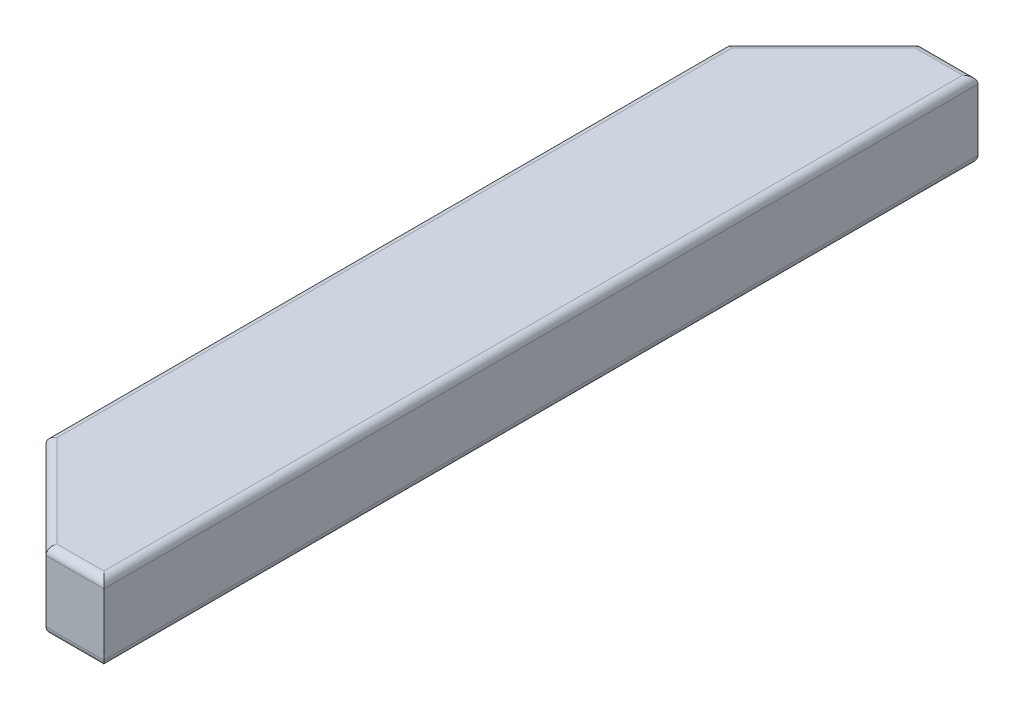
ISO-10303-21;
HEADER;
FILE_DESCRIPTION(('STEP AP214'),'2;1');
FILE_NAME('part.step','',(''),(''),'','','');
FILE_SCHEMA(('AUTOMOTIVE_DESIGN { 1 0 10303 214 1 1 1 1 }'));
ENDSEC;
DATA;
#1=APPLICATION_CONTEXT('core data for automotive mechanical design processes');
#2=APPLICATION_PROTOCOL_DEFINITION('international standard','automotive_design',2000,#1);
#3=PRODUCT_CONTEXT('',#1,'mechanical');
#4=PRODUCT('Part','Part','',(#3));
#5=PRODUCT_RELATED_PRODUCT_CATEGORY('part','',(#4));
#6=PRODUCT_DEFINITION_FORMATION('','',#4);
#7=PRODUCT_DEFINITION_CONTEXT('part definition',#1,'design');
#8=PRODUCT_DEFINITION('design','',#6,#7);
#9=PRODUCT_DEFINITION_SHAPE('','',#8);
#10=(LENGTH_UNIT() NAMED_UNIT(*) SI_UNIT(.MILLI.,.METRE.));
#11=(NAMED_UNIT(*) PLANE_ANGLE_UNIT() SI_UNIT($,.RADIAN.));
#12=(NAMED_UNIT(*) SI_UNIT($,.STERADIAN.) SOLID_ANGLE_UNIT());
#13=UNCERTAINTY_MEASURE_WITH_UNIT(LENGTH_MEASURE(1.E-05),#10,'distance_accuracy_value','');
#14=(GEOMETRIC_REPRESENTATION_CONTEXT(3) GLOBAL_UNCERTAINTY_ASSIGNED_CONTEXT((#13)) GLOBAL_UNIT_ASSIGNED_CONTEXT((#10,
#11,#12)) REPRESENTATION_CONTEXT('',''));
#15=CARTESIAN_POINT('',(0.,0.,0.));
#16=DIRECTION('',(0.,0.,1.));
#17=DIRECTION('',(1.,0.,0.));
#18=AXIS2_PLACEMENT_3D('',#15,#16,#17);
#19=CARTESIAN_POINT('',(0.,5.3444781408848E-12,287.699999999991));
#20=DIRECTION('',(0.,0.,-1.));
#21=DIRECTION('',(0.,1.,0.));
#22=AXIS2_PLACEMENT_3D('',#19,#20,#21);
#23=PLANE('',#22);
#24=DIRECTION('',(0.,1.,0.));
#25=VECTOR('',#24,1.);
#26=CARTESIAN_POINT('',(2676.19999999996,-12.7000000000022,287.699999999991));
#27=LINE('',#26,#25);
#28=CARTESIAN_POINT('',(2676.19999999996,-7.61999999998973,287.699999999991));
#29=VERTEX_POINT('',#28);
#30=CARTESIAN_POINT('',(2676.19999999996,33.0200000000108,287.699999999991));
#31=VERTEX_POINT('',#30);
#32=EDGE_CURVE('E290',#29,#31,#27,.T.);
#33=ORIENTED_EDGE('',*,*,#32,.F.);
#34=DIRECTION('',(-1.,0.,0.));
#35=VECTOR('',#34,1.);
#36=CARTESIAN_POINT('',(0.,-7.61999999998973,287.699999999991));
#37=LINE('',#36,#35);
#38=CARTESIAN_POINT('',(2714.29999999996,-7.61999999998973,287.699999999991));
#39=VERTEX_POINT('',#38);
#40=EDGE_CURVE('E187',#29,#39,#37,.F.);
#41=ORIENTED_EDGE('',*,*,#40,.T.);
#42=DIRECTION('',(0.,-1.,0.));
#43=VECTOR('',#42,1.);
#44=CARTESIAN_POINT('',(2714.29999999996,38.1000000000108,287.69999999999));
#45=LINE('',#44,#43);
#46=CARTESIAN_POINT('',(2714.29999999996,33.0200000000108,287.69999999999));
#47=VERTEX_POINT('',#46);
#48=EDGE_CURVE('E169',#47,#39,#45,.T.);
#49=ORIENTED_EDGE('',*,*,#48,.F.);
#50=DIRECTION('',(1.,0.,0.));
#51=VECTOR('',#50,1.);
#52=CARTESIAN_POINT('',(0.,33.0200000000108,287.69999999999));
#53=LINE('',#52,#51);
#54=EDGE_CURVE('E183',#47,#31,#53,.F.);
#55=ORIENTED_EDGE('',*,*,#54,.T.);
#56=EDGE_LOOP('',(#33,#41,#49,#55));
#57=FACE_BOUND('',#56,.T.);
#58=ADVANCED_FACE('F43',(#57),#23,.F.);
#59=CARTESIAN_POINT('',(2714.29999999996,38.0999999999983,-401.292253256991));
#60=DIRECTION('',(0.,-1.,0.));
#61=DIRECTION('',(0.,0.,-1.));
#62=AXIS2_PLACEMENT_3D('',#59,#60,#61);
#63=PLANE('',#62);
#64=DIRECTION('',(0.707106781186546,0.,-0.707106781186549));
#65=VECTOR('',#64,1.);
#66=CARTESIAN_POINT('',(2755.63822907689,38.0999999999991,-359.954024180063));
#67=LINE('',#66,#65);
#68=CARTESIAN_POINT('',(2678.30420489683,38.1000000000005,-282.620000000002));
#69=VERTEX_POINT('',#68);
#70=CARTESIAN_POINT('',(2617.77999999996,38.1000000000016,-222.095795103136));
#71=VERTEX_POINT('',#70);
#72=EDGE_CURVE('E207',#69,#71,#67,.F.);
#73=ORIENTED_EDGE('',*,*,#72,.T.);
#74=DIRECTION('',(0.,0.,1.));
#75=VECTOR('',#74,1.);
#76=CARTESIAN_POINT('',(2617.77999999996,38.0999999999983,-401.292253256991));
#77=LINE('',#76,#75);
#78=CARTESIAN_POINT('',(2617.77999999996,38.1000000000096,222.095795103134));
#79=VERTEX_POINT('',#78);
#80=EDGE_CURVE('E213',#71,#79,#77,.T.);
#81=ORIENTED_EDGE('',*,*,#80,.T.);
#82=DIRECTION('',(-0.707106781186543,0.,-0.707106781186552));
#83=VECTOR('',#82,1.);
#84=CARTESIAN_POINT('',(2354.3459758199,38.1000000000049,-41.3382290769324));
#85=LINE('',#84,#83);
#86=CARTESIAN_POINT('',(2678.30420489682,38.1000000000107,282.61999999999));
#87=VERTEX_POINT('',#86);
#88=EDGE_CURVE('E210',#79,#87,#85,.F.);
#89=ORIENTED_EDGE('',*,*,#88,.T.);
#90=DIRECTION('',(1.,0.,0.));
#91=VECTOR('',#90,1.);
#92=CARTESIAN_POINT('',(2714.29999999996,38.1000000000107,282.61999999999));
#93=LINE('',#92,#91);
#94=CARTESIAN_POINT('',(2709.21999999996,38.1000000000107,282.61999999999));
#95=VERTEX_POINT('',#94);
#96=EDGE_CURVE('E203',#87,#95,#93,.T.);
#97=ORIENTED_EDGE('',*,*,#96,.T.);
#98=DIRECTION('',(0.,0.,1.));
#99=VECTOR('',#98,1.);
#100=CARTESIAN_POINT('',(2709.21999999996,38.0999999999983,-401.292253256991));
#101=LINE('',#100,#99);
#102=CARTESIAN_POINT('',(2709.21999999996,38.1000000000005,-282.620000000002));
#103=VERTEX_POINT('',#102);
#104=EDGE_CURVE('E197',#95,#103,#101,.F.);
#105=ORIENTED_EDGE('',*,*,#104,.T.);
#106=DIRECTION('',(-1.,0.,0.));
#107=VECTOR('',#106,1.);
#108=CARTESIAN_POINT('',(2714.29999999996,38.1000000000005,-282.620000000002));
#109=LINE('',#108,#107);
#110=EDGE_CURVE('E200',#103,#69,#109,.T.);
#111=ORIENTED_EDGE('',*,*,#110,.T.);
#112=EDGE_LOOP('',(#73,#81,#89,#97,#105,#111));
#113=FACE_BOUND('',#112,.T.);
#114=ADVANCED_FACE('F335',(#113),#63,.F.);
#115=CARTESIAN_POINT('',(2612.69999999996,38.0999999999983,-401.292253256991));
#116=DIRECTION('',(1.,0.,0.));
#117=DIRECTION('',(0.,0.,-1.));
#118=AXIS2_PLACEMENT_3D('',#115,#116,#117);
#119=PLANE('',#118);
#120=DIRECTION('',(0.,1.,0.));
#121=VECTOR('',#120,1.);
#122=CARTESIAN_POINT('',(2612.69999999996,-12.7000000000114,-224.19999999999));
#123=LINE('',#122,#121);
#124=CARTESIAN_POINT('',(2612.69999999996,-7.61999999999898,-224.19999999999));
#125=VERTEX_POINT('',#124);
#126=CARTESIAN_POINT('',(2612.69999999996,33.0200000000015,-224.199999999991));
#127=VERTEX_POINT('',#126);
#128=EDGE_CURVE('E281',#125,#127,#123,.T.);
#129=ORIENTED_EDGE('',*,*,#128,.F.);
#130=DIRECTION('',(0.,0.,1.));
#131=VECTOR('',#130,1.);
#132=CARTESIAN_POINT('',(2612.69999999996,-7.62000000000218,-401.29225325699));
#133=LINE('',#132,#131);
#134=CARTESIAN_POINT('',(2612.69999999996,-7.61999999999087,224.199999999991));
#135=VERTEX_POINT('',#134);
#136=EDGE_CURVE('E228',#125,#135,#133,.T.);
#137=ORIENTED_EDGE('',*,*,#136,.T.);
#138=DIRECTION('',(0.,1.,0.));
#139=VECTOR('',#138,1.);
#140=CARTESIAN_POINT('',(2612.69999999996,-12.7000000000033,224.199999999991));
#141=LINE('',#140,#139);
#142=CARTESIAN_POINT('',(2612.69999999996,33.0200000000096,224.19999999999));
#143=VERTEX_POINT('',#142);
#144=EDGE_CURVE('E247',#135,#143,#141,.T.);
#145=ORIENTED_EDGE('',*,*,#144,.T.);
#146=DIRECTION('',(0.,0.,1.));
#147=VECTOR('',#146,1.);
#148=CARTESIAN_POINT('',(2612.69999999996,33.0199999999983,-401.292253256991));
#149=LINE('',#148,#147);
#150=EDGE_CURVE('E61',#143,#127,#149,.F.);
#151=ORIENTED_EDGE('',*,*,#150,.T.);
#152=EDGE_LOOP('',(#129,#137,#145,#151));
#153=FACE_BOUND('',#152,.T.);
#154=ADVANCED_FACE('F298',(#153),#119,.F.);
#155=CARTESIAN_POINT('',(2714.29999999996,-12.7000000000022,-401.29225325699));
#156=DIRECTION('',(0.,1.,0.));
#157=DIRECTION('',(0.,0.,1.));
#158=AXIS2_PLACEMENT_3D('',#155,#156,#157);
#159=PLANE('',#158);
#160=DIRECTION('',(-0.707106781186543,0.,-0.707106781186552));
#161=VECTOR('',#160,1.);
#162=CARTESIAN_POINT('',(2354.3459758199,-12.6999999999957,-41.3382290769314));
#163=LINE('',#162,#161);
#164=CARTESIAN_POINT('',(2678.30420489682,-12.6999999999898,282.619999999991));
#165=VERTEX_POINT('',#164);
#166=CARTESIAN_POINT('',(2617.77999999996,-12.6999999999909,222.095795103135));
#167=VERTEX_POINT('',#166);
#168=EDGE_CURVE('E177',#165,#167,#163,.T.);
#169=ORIENTED_EDGE('',*,*,#168,.T.);
#170=DIRECTION('',(0.,0.,1.));
#171=VECTOR('',#170,1.);
#172=CARTESIAN_POINT('',(2617.77999999996,-12.7000000000022,-401.29225325699));
#173=LINE('',#172,#171);
#174=CARTESIAN_POINT('',(2617.77999999996,-12.6999999999989,-222.095795103135));
#175=VERTEX_POINT('',#174);
#176=EDGE_CURVE('E180',#167,#175,#173,.F.);
#177=ORIENTED_EDGE('',*,*,#176,.T.);
#178=DIRECTION('',(0.707106781186546,0.,-0.707106781186549));
#179=VECTOR('',#178,1.);
#180=CARTESIAN_POINT('',(2755.63822907689,-12.7000000000014,-359.954024180062));
#181=LINE('',#180,#179);
#182=CARTESIAN_POINT('',(2678.30420489683,-12.7,-282.620000000001));
#183=VERTEX_POINT('',#182);
#184=EDGE_CURVE('E143',#175,#183,#181,.T.);
#185=ORIENTED_EDGE('',*,*,#184,.T.);
#186=DIRECTION('',(1.,0.,0.));
#187=VECTOR('',#186,1.);
#188=CARTESIAN_POINT('',(2714.29999999996,-12.7,-282.620000000001));
#189=LINE('',#188,#187);
#190=CARTESIAN_POINT('',(2709.21999999996,-12.7,-282.620000000001));
#191=VERTEX_POINT('',#190);
#192=EDGE_CURVE('E135',#183,#191,#189,.T.);
#193=ORIENTED_EDGE('',*,*,#192,.T.);
#194=DIRECTION('',(0.,0.,1.));
#195=VECTOR('',#194,1.);
#196=CARTESIAN_POINT('',(2709.21999999996,-12.7000000000022,-401.29225325699));
#197=LINE('',#196,#195);
#198=CARTESIAN_POINT('',(2709.21999999996,-12.6999999999898,282.619999999991));
#199=VERTEX_POINT('',#198);
#200=EDGE_CURVE('E140',#191,#199,#197,.T.);
#201=ORIENTED_EDGE('',*,*,#200,.T.);
#202=DIRECTION('',(-1.,0.,0.));
#203=VECTOR('',#202,1.);
#204=CARTESIAN_POINT('',(2714.29999999996,-12.6999999999898,282.619999999991));
#205=LINE('',#204,#203);
#206=EDGE_CURVE('E148',#199,#165,#205,.T.);
#207=ORIENTED_EDGE('',*,*,#206,.T.);
#208=EDGE_LOOP('',(#169,#177,#185,#193,#201,#207));
#209=FACE_BOUND('',#208,.T.);
#210=ADVANCED_FACE('F137',(#209),#159,.F.);
#211=CARTESIAN_POINT('',(2714.29999999996,38.0999999999983,-401.292253256991));
#212=DIRECTION('',(-1.,0.,0.));
#213=DIRECTION('',(0.,0.,1.));
#214=AXIS2_PLACEMENT_3D('',#211,#212,#213);
#215=PLANE('',#214);
#216=ORIENTED_EDGE('',*,*,#48,.T.);
#217=DIRECTION('',(0.,0.,1.));
#218=VECTOR('',#217,1.);
#219=CARTESIAN_POINT('',(2714.29999999996,-7.62000000000219,-401.29225325699));
#220=LINE('',#219,#218);
#221=CARTESIAN_POINT('',(2714.29999999996,-7.62000000000013,-287.700000000001));
#222=VERTEX_POINT('',#221);
#223=EDGE_CURVE('E11',#39,#222,#220,.F.);
#224=ORIENTED_EDGE('',*,*,#223,.T.);
#225=DIRECTION('',(0.,1.,0.));
#226=VECTOR('',#225,1.);
#227=CARTESIAN_POINT('',(2714.29999999996,38.1000000000004,-287.700000000002));
#228=LINE('',#227,#226);
#229=CARTESIAN_POINT('',(2714.29999999996,33.0200000000004,-287.700000000002));
#230=VERTEX_POINT('',#229);
#231=EDGE_CURVE('E165',#222,#230,#228,.T.);
#232=ORIENTED_EDGE('',*,*,#231,.T.);
#233=DIRECTION('',(0.,0.,1.));
#234=VECTOR('',#233,1.);
#235=CARTESIAN_POINT('',(2714.29999999996,33.0199999999983,-401.292253256991));
#236=LINE('',#235,#234);
#237=EDGE_CURVE('E53',#230,#47,#236,.T.);
#238=ORIENTED_EDGE('',*,*,#237,.T.);
#239=EDGE_LOOP('',(#216,#224,#232,#238));
#240=FACE_BOUND('',#239,.T.);
#241=ADVANCED_FACE('F320',(#240),#215,.F.);
#242=CARTESIAN_POINT('',(2714.29999999996,38.1000000000004,-287.700000000002));
#243=DIRECTION('',(0.,0.,1.));
#244=DIRECTION('',(0.,-1.,0.));
#245=AXIS2_PLACEMENT_3D('',#242,#243,#244);
#246=PLANE('',#245);
#247=ORIENTED_EDGE('',*,*,#231,.F.);
#248=DIRECTION('',(1.,0.,0.));
#249=VECTOR('',#248,1.);
#250=CARTESIAN_POINT('',(2714.29999999996,-7.62000000000013,-287.700000000001));
#251=LINE('',#250,#249);
#252=CARTESIAN_POINT('',(2676.19999999996,-7.62000000000013,-287.69999999999));
#253=VERTEX_POINT('',#252);
#254=EDGE_CURVE('E154',#222,#253,#251,.F.);
#255=ORIENTED_EDGE('',*,*,#254,.T.);
#256=DIRECTION('',(0.,1.,0.));
#257=VECTOR('',#256,1.);
#258=CARTESIAN_POINT('',(2676.19999999996,-12.7000000000126,-287.69999999999));
#259=LINE('',#258,#257);
#260=CARTESIAN_POINT('',(2676.19999999996,33.0200000000004,-287.699999999991));
#261=VERTEX_POINT('',#260);
#262=EDGE_CURVE('E280',#253,#261,#259,.T.);
#263=ORIENTED_EDGE('',*,*,#262,.T.);
#264=DIRECTION('',(-1.,0.,0.));
#265=VECTOR('',#264,1.);
#266=CARTESIAN_POINT('',(2714.29999999996,33.0200000000004,-287.700000000002));
#267=LINE('',#266,#265);
#268=EDGE_CURVE('E216',#261,#230,#267,.F.);
#269=ORIENTED_EDGE('',*,*,#268,.T.);
#270=EDGE_LOOP('',(#247,#255,#263,#269));
#271=FACE_BOUND('',#270,.T.);
#272=ADVANCED_FACE('F284',(#271),#246,.F.);
#273=CARTESIAN_POINT('',(2676.19999999996,-12.7000000000126,-287.69999999999));
#274=DIRECTION('',(0.707106781186549,0.,0.707106781186546));
#275=DIRECTION('',(0.707106781186546,0.,-0.707106781186549));
#276=AXIS2_PLACEMENT_3D('',#273,#274,#275);
#277=PLANE('',#276);
#278=ORIENTED_EDGE('',*,*,#262,.F.);
#279=DIRECTION('',(0.707106781186546,0.,-0.707106781186549));
#280=VECTOR('',#279,1.);
#281=CARTESIAN_POINT('',(2676.19999999996,-7.62000000000013,-287.69999999999));
#282=LINE('',#281,#280);
#283=EDGE_CURVE('E68',#253,#125,#282,.F.);
#284=ORIENTED_EDGE('',*,*,#283,.T.);
#285=ORIENTED_EDGE('',*,*,#128,.T.);
#286=DIRECTION('',(0.707106781186546,0.,-0.707106781186549));
#287=VECTOR('',#286,1.);
#288=CARTESIAN_POINT('',(2676.19999999996,33.0200000000004,-287.699999999991));
#289=LINE('',#288,#287);
#290=EDGE_CURVE('E221',#127,#261,#289,.T.);
#291=ORIENTED_EDGE('',*,*,#290,.T.);
#292=EDGE_LOOP('',(#278,#284,#285,#291));
#293=FACE_BOUND('',#292,.T.);
#294=ADVANCED_FACE('F279',(#293),#277,.F.);
#295=CARTESIAN_POINT('',(2676.19999999996,-12.7000000000022,287.699999999991));
#296=DIRECTION('',(0.707106781186552,0.,-0.707106781186543));
#297=DIRECTION('',(-0.707106781186543,0.,-0.707106781186552));
#298=AXIS2_PLACEMENT_3D('',#295,#296,#297);
#299=PLANE('',#298);
#300=ORIENTED_EDGE('',*,*,#144,.F.);
#301=DIRECTION('',(-0.707106781186543,0.,-0.707106781186552));
#302=VECTOR('',#301,1.);
#303=CARTESIAN_POINT('',(2676.19999999996,-7.61999999998973,287.699999999991));
#304=LINE('',#303,#302);
#305=EDGE_CURVE('E194',#135,#29,#304,.F.);
#306=ORIENTED_EDGE('',*,*,#305,.T.);
#307=ORIENTED_EDGE('',*,*,#32,.T.);
#308=DIRECTION('',(-0.707106781186543,0.,-0.707106781186552));
#309=VECTOR('',#308,1.);
#310=CARTESIAN_POINT('',(2676.19999999996,33.0200000000108,287.699999999991));
#311=LINE('',#310,#309);
#312=EDGE_CURVE('E191',#31,#143,#311,.T.);
#313=ORIENTED_EDGE('',*,*,#312,.T.);
#314=EDGE_LOOP('',(#300,#306,#307,#313));
#315=FACE_BOUND('',#314,.T.);
#316=ADVANCED_FACE('F302',(#315),#299,.F.);
#317=CARTESIAN_POINT('',(2755.63822907689,-7.62000000000144,-359.954024180063));
#318=DIRECTION('',(0.707106781186546,0.,-0.707106781186549));
#319=DIRECTION('',(-0.707106781186549,0.,-0.707106781186546));
#320=AXIS2_PLACEMENT_3D('',#317,#318,#319);
#321=CYLINDRICAL_SURFACE('',#320,5.08);
#322=CARTESIAN_POINT('',(2617.77999999996,-7.61999999999894,-222.095795103135));
#323=DIRECTION('',(-0.382683432365089,0.,0.923879532511287));
#324=DIRECTION('',(0.923879532511287,0.,0.382683432365089));
#325=AXIS2_PLACEMENT_3D('',#322,#323,#324);
#326=ELLIPSE('',#325,5.49855237748536,5.08);
#327=EDGE_CURVE('E158',#125,#175,#326,.T.);
#328=ORIENTED_EDGE('',*,*,#327,.F.);
#329=ORIENTED_EDGE('',*,*,#283,.F.);
#330=CARTESIAN_POINT('',(2678.30420489683,-7.62000000000004,-282.620000000001));
#331=DIRECTION('',(0.923879532511286,0.,-0.382683432365091));
#332=DIRECTION('',(-0.382683432365091,0.,-0.923879532511286));
#333=AXIS2_PLACEMENT_3D('',#330,#331,#332);
#334=ELLIPSE('',#333,5.49855237748536,5.08);
#335=EDGE_CURVE('E244',#183,#253,#334,.T.);
#336=ORIENTED_EDGE('',*,*,#335,.F.);
#337=ORIENTED_EDGE('',*,*,#184,.F.);
#338=EDGE_LOOP('',(#328,#329,#336,#337));
#339=FACE_BOUND('',#338,.T.);
#340=ADVANCED_FACE('F369',(#339),#321,.T.);
#341=CARTESIAN_POINT('',(2714.29999999996,-7.62000000000004,-282.620000000001));
#342=DIRECTION('',(1.,0.,0.));
#343=DIRECTION('',(0.,0.,-1.));
#344=AXIS2_PLACEMENT_3D('',#341,#342,#343);
#345=CYLINDRICAL_SURFACE('',#344,5.08);
#346=ORIENTED_EDGE('',*,*,#335,.T.);
#347=ORIENTED_EDGE('',*,*,#254,.F.);
#348=CARTESIAN_POINT('',(2709.21999999996,-7.62000000000004,-282.620000000001));
#349=DIRECTION('',(0.707106781186547,0.,0.707106781186548));
#350=DIRECTION('',(-0.707106781186548,0.,0.707106781186547));
#351=AXIS2_PLACEMENT_3D('',#348,#349,#350);
#352=ELLIPSE('',#351,7.18420489685532,5.08);
#353=EDGE_CURVE('E152',#191,#222,#352,.T.);
#354=ORIENTED_EDGE('',*,*,#353,.F.);
#355=ORIENTED_EDGE('',*,*,#192,.F.);
#356=EDGE_LOOP('',(#346,#347,#354,#355));
#357=FACE_BOUND('',#356,.T.);
#358=ADVANCED_FACE('F153',(#357),#345,.T.);
#359=CARTESIAN_POINT('',(2617.77999999996,-7.62000000000218,-401.29225325699));
#360=DIRECTION('',(0.,0.,1.));
#361=DIRECTION('',(0.,-1.,0.));
#362=AXIS2_PLACEMENT_3D('',#359,#360,#361);
#363=CYLINDRICAL_SURFACE('',#362,5.08);
#364=ORIENTED_EDGE('',*,*,#327,.T.);
#365=ORIENTED_EDGE('',*,*,#176,.F.);
#366=CARTESIAN_POINT('',(2617.77999999996,-7.61999999999091,222.095795103135));
#367=DIRECTION('',(0.382683432365087,0.,0.923879532511288));
#368=DIRECTION('',(-0.923879532511288,0.,0.382683432365087));
#369=AXIS2_PLACEMENT_3D('',#366,#367,#368);
#370=ELLIPSE('',#369,5.49855237748536,5.08);
#371=EDGE_CURVE('E159',#135,#167,#370,.T.);
#372=ORIENTED_EDGE('',*,*,#371,.F.);
#373=ORIENTED_EDGE('',*,*,#136,.F.);
#374=EDGE_LOOP('',(#364,#365,#372,#373));
#375=FACE_BOUND('',#374,.T.);
#376=ADVANCED_FACE('F308',(#375),#363,.T.);
#377=CARTESIAN_POINT('',(2709.21999999996,-7.62000000000219,-401.29225325699));
#378=DIRECTION('',(0.,0.,1.));
#379=DIRECTION('',(0.,-1.,0.));
#380=AXIS2_PLACEMENT_3D('',#377,#378,#379);
#381=CYLINDRICAL_SURFACE('',#380,5.08);
#382=ORIENTED_EDGE('',*,*,#353,.T.);
#383=ORIENTED_EDGE('',*,*,#223,.F.);
#384=CARTESIAN_POINT('',(2709.21999999996,-7.61999999998982,282.619999999991));
#385=DIRECTION('',(-0.707106781186548,0.,0.707106781186547));
#386=DIRECTION('',(0.707106781186547,0.,0.707106781186548));
#387=AXIS2_PLACEMENT_3D('',#384,#385,#386);
#388=ELLIPSE('',#387,7.18420489685532,5.08);
#389=EDGE_CURVE('E162',#199,#39,#388,.T.);
#390=ORIENTED_EDGE('',*,*,#389,.F.);
#391=ORIENTED_EDGE('',*,*,#200,.F.);
#392=EDGE_LOOP('',(#382,#383,#390,#391));
#393=FACE_BOUND('',#392,.T.);
#394=ADVANCED_FACE('F161',(#393),#381,.T.);
#395=CARTESIAN_POINT('',(2354.3459758199,-7.61999999999568,-41.3382290769315));
#396=DIRECTION('',(-0.707106781186543,0.,-0.707106781186552));
#397=DIRECTION('',(-0.707106781186552,0.,0.707106781186543));
#398=AXIS2_PLACEMENT_3D('',#395,#396,#397);
#399=CYLINDRICAL_SURFACE('',#398,5.08);
#400=ORIENTED_EDGE('',*,*,#371,.T.);
#401=ORIENTED_EDGE('',*,*,#168,.F.);
#402=CARTESIAN_POINT('',(2678.30420489682,-7.61999999998982,282.619999999991));
#403=DIRECTION('',(-0.923879532511286,0.,-0.382683432365093));
#404=DIRECTION('',(0.382683432365093,0.,-0.923879532511286));
#405=AXIS2_PLACEMENT_3D('',#402,#403,#404);
#406=ELLIPSE('',#405,5.49855237748537,5.08);
#407=EDGE_CURVE('E233',#29,#165,#406,.F.);
#408=ORIENTED_EDGE('',*,*,#407,.F.);
#409=ORIENTED_EDGE('',*,*,#305,.F.);
#410=EDGE_LOOP('',(#400,#401,#408,#409));
#411=FACE_BOUND('',#410,.T.);
#412=ADVANCED_FACE('F312',(#411),#399,.T.);
#413=CARTESIAN_POINT('',(2714.29999999996,-7.61999999998982,282.619999999991));
#414=DIRECTION('',(-1.,0.,0.));
#415=DIRECTION('',(0.,0.,1.));
#416=AXIS2_PLACEMENT_3D('',#413,#414,#415);
#417=CYLINDRICAL_SURFACE('',#416,5.08);
#418=ORIENTED_EDGE('',*,*,#389,.T.);
#419=ORIENTED_EDGE('',*,*,#40,.F.);
#420=ORIENTED_EDGE('',*,*,#407,.T.);
#421=ORIENTED_EDGE('',*,*,#206,.F.);
#422=EDGE_LOOP('',(#418,#419,#420,#421));
#423=FACE_BOUND('',#422,.T.);
#424=ADVANCED_FACE('F315',(#423),#417,.T.);
#425=CARTESIAN_POINT('',(2679.79210244839,33.0200000000005,-284.107897551564));
#426=DIRECTION('',(0.707106781186546,0.,-0.707106781186549));
#427=DIRECTION('',(-0.707106781186549,0.,-0.707106781186546));
#428=AXIS2_PLACEMENT_3D('',#425,#426,#427);
#429=CYLINDRICAL_SURFACE('',#428,5.08);
#430=CARTESIAN_POINT('',(2678.30420489683,33.0200000000005,-282.620000000002));
#431=DIRECTION('',(0.923879532511286,0.,-0.382683432365091));
#432=DIRECTION('',(-0.382683432365091,0.,-0.923879532511286));
#433=AXIS2_PLACEMENT_3D('',#430,#431,#432);
#434=ELLIPSE('',#433,5.49855237748536,5.08);
#435=EDGE_CURVE('E261',#261,#69,#434,.T.);
#436=ORIENTED_EDGE('',*,*,#435,.F.);
#437=ORIENTED_EDGE('',*,*,#290,.F.);
#438=CARTESIAN_POINT('',(2617.77999999996,33.0200000000016,-222.095795103136));
#439=DIRECTION('',(-0.382683432365089,0.,0.923879532511287));
#440=DIRECTION('',(0.923879532511287,0.,0.382683432365089));
#441=AXIS2_PLACEMENT_3D('',#438,#439,#440);
#442=ELLIPSE('',#441,5.49855237748536,5.08);
#443=EDGE_CURVE('E47',#71,#127,#442,.T.);
#444=ORIENTED_EDGE('',*,*,#443,.F.);
#445=ORIENTED_EDGE('',*,*,#72,.F.);
#446=EDGE_LOOP('',(#436,#437,#444,#445));
#447=FACE_BOUND('',#446,.T.);
#448=ADVANCED_FACE('F45',(#447),#429,.T.);
#449=CARTESIAN_POINT('',(2617.77999999996,33.0199999999983,-401.292253256991));
#450=DIRECTION('',(0.,0.,1.));
#451=DIRECTION('',(0.,-1.,0.));
#452=AXIS2_PLACEMENT_3D('',#449,#450,#451);
#453=CYLINDRICAL_SURFACE('',#452,5.08);
#454=ORIENTED_EDGE('',*,*,#443,.T.);
#455=ORIENTED_EDGE('',*,*,#150,.F.);
#456=CARTESIAN_POINT('',(2617.77999999996,33.0200000000096,222.095795103134));
#457=DIRECTION('',(0.382683432365087,0.,0.923879532511288));
#458=DIRECTION('',(-0.923879532511288,0.,0.382683432365087));
#459=AXIS2_PLACEMENT_3D('',#456,#457,#458);
#460=ELLIPSE('',#459,5.49855237748536,5.08);
#461=EDGE_CURVE('E258',#79,#143,#460,.T.);
#462=ORIENTED_EDGE('',*,*,#461,.F.);
#463=ORIENTED_EDGE('',*,*,#80,.F.);
#464=EDGE_LOOP('',(#454,#455,#462,#463));
#465=FACE_BOUND('',#464,.T.);
#466=ADVANCED_FACE('F273',(#465),#453,.T.);
#467=CARTESIAN_POINT('',(2714.29999999996,33.0200000000005,-282.620000000002));
#468=DIRECTION('',(-1.,0.,0.));
#469=DIRECTION('',(0.,0.,1.));
#470=AXIS2_PLACEMENT_3D('',#467,#468,#469);
#471=CYLINDRICAL_SURFACE('',#470,5.08);
#472=ORIENTED_EDGE('',*,*,#435,.T.);
#473=ORIENTED_EDGE('',*,*,#110,.F.);
#474=CARTESIAN_POINT('',(2709.21999999996,33.0200000000005,-282.620000000002));
#475=DIRECTION('',(0.707106781186547,0.,0.707106781186548));
#476=DIRECTION('',(-0.707106781186548,0.,0.707106781186547));
#477=AXIS2_PLACEMENT_3D('',#474,#475,#476);
#478=ELLIPSE('',#477,7.18420489685532,5.08);
#479=EDGE_CURVE('E254',#230,#103,#478,.T.);
#480=ORIENTED_EDGE('',*,*,#479,.F.);
#481=ORIENTED_EDGE('',*,*,#268,.F.);
#482=EDGE_LOOP('',(#472,#473,#480,#481));
#483=FACE_BOUND('',#482,.T.);
#484=ADVANCED_FACE('F336',(#483),#471,.T.);
#485=CARTESIAN_POINT('',(2679.79210244839,33.0200000000107,284.107897551563));
#486=DIRECTION('',(-0.707106781186543,0.,-0.707106781186552));
#487=DIRECTION('',(-0.707106781186552,0.,0.707106781186543));
#488=AXIS2_PLACEMENT_3D('',#485,#486,#487);
#489=CYLINDRICAL_SURFACE('',#488,5.08);
#490=ORIENTED_EDGE('',*,*,#461,.T.);
#491=ORIENTED_EDGE('',*,*,#312,.F.);
#492=CARTESIAN_POINT('',(2678.30420489682,33.0200000000107,282.61999999999));
#493=DIRECTION('',(-0.923879532511286,0.,-0.382683432365093));
#494=DIRECTION('',(0.382683432365093,0.,-0.923879532511286));
#495=AXIS2_PLACEMENT_3D('',#492,#493,#494);
#496=ELLIPSE('',#495,5.49855237748537,5.08);
#497=EDGE_CURVE('E251',#87,#31,#496,.F.);
#498=ORIENTED_EDGE('',*,*,#497,.F.);
#499=ORIENTED_EDGE('',*,*,#88,.F.);
#500=EDGE_LOOP('',(#490,#491,#498,#499));
#501=FACE_BOUND('',#500,.T.);
#502=ADVANCED_FACE('F333',(#501),#489,.T.);
#503=CARTESIAN_POINT('',(2709.21999999996,33.0199999999983,-401.292253256991));
#504=DIRECTION('',(0.,0.,1.));
#505=DIRECTION('',(0.,-1.,0.));
#506=AXIS2_PLACEMENT_3D('',#503,#504,#505);
#507=CYLINDRICAL_SURFACE('',#506,5.08);
#508=ORIENTED_EDGE('',*,*,#479,.T.);
#509=ORIENTED_EDGE('',*,*,#104,.F.);
#510=CARTESIAN_POINT('',(2709.21999999996,33.0200000000107,282.61999999999));
#511=DIRECTION('',(-0.707106781186548,0.,0.707106781186547));
#512=DIRECTION('',(0.707106781186547,0.,0.707106781186548));
#513=AXIS2_PLACEMENT_3D('',#510,#511,#512);
#514=ELLIPSE('',#513,7.18420489685532,5.08);
#515=EDGE_CURVE('E248',#47,#95,#514,.T.);
#516=ORIENTED_EDGE('',*,*,#515,.F.);
#517=ORIENTED_EDGE('',*,*,#237,.F.);
#518=EDGE_LOOP('',(#508,#509,#516,#517));
#519=FACE_BOUND('',#518,.T.);
#520=ADVANCED_FACE('F325',(#519),#507,.T.);
#521=CARTESIAN_POINT('',(2714.29999999996,33.0200000000107,282.61999999999));
#522=DIRECTION('',(1.,0.,0.));
#523=DIRECTION('',(0.,0.,-1.));
#524=AXIS2_PLACEMENT_3D('',#521,#522,#523);
#525=CYLINDRICAL_SURFACE('',#524,5.08);
#526=ORIENTED_EDGE('',*,*,#497,.T.);
#527=ORIENTED_EDGE('',*,*,#54,.F.);
#528=ORIENTED_EDGE('',*,*,#515,.T.);
#529=ORIENTED_EDGE('',*,*,#96,.F.);
#530=EDGE_LOOP('',(#526,#527,#528,#529));
#531=FACE_BOUND('',#530,.T.);
#532=ADVANCED_FACE('F329',(#531),#525,.T.);
#533=CLOSED_SHELL('',(#58,#114,#154,#210,#241,#272,#294,#316,#340,#358,#376,#394,#412,#424,#448,
#466,#484,#502,#520,#532));
#534=MANIFOLD_SOLID_BREP('B2',#533);
#535=ADVANCED_BREP_SHAPE_REPRESENTATION('',(#18,#534),#14);
#536=SHAPE_DEFINITION_REPRESENTATION(#9,#535);
ENDSEC;
END-ISO-10303-21;
